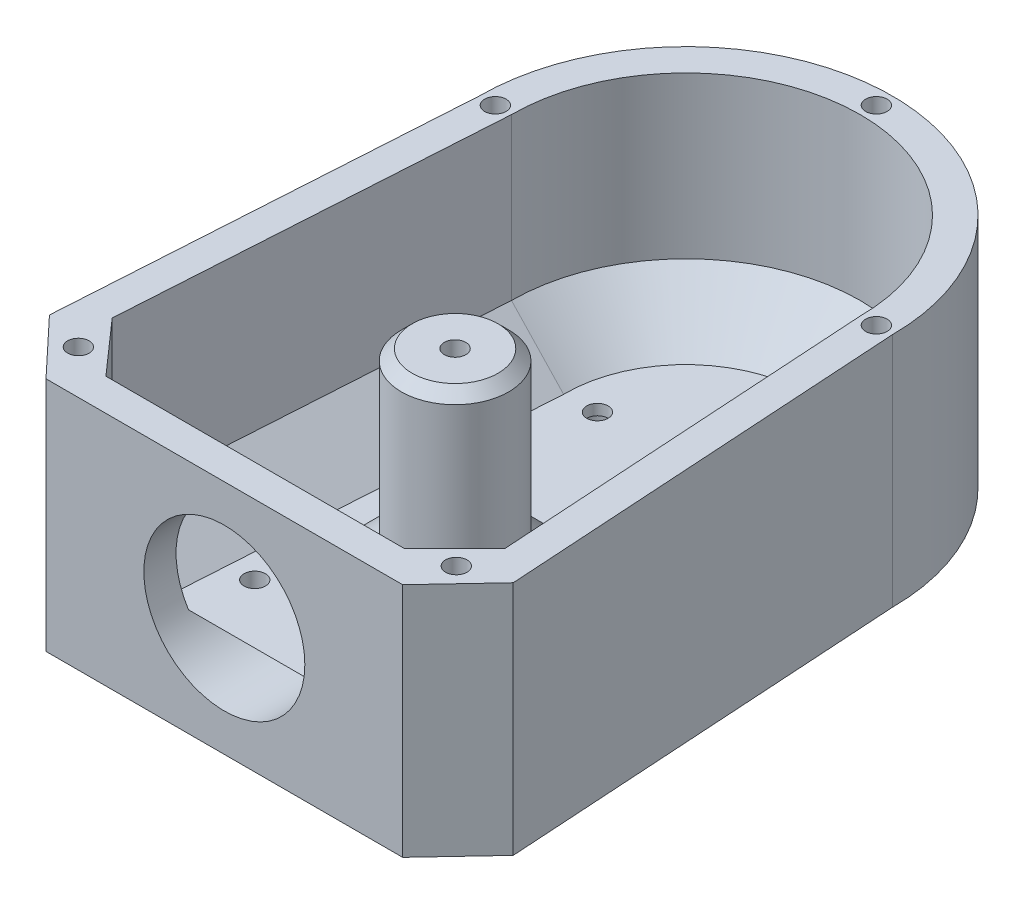
ISO-10303-21;
HEADER;
FILE_DESCRIPTION(('STEP AP214'),'2;1');
FILE_NAME('part.step','',(''),(''),'','','');
FILE_SCHEMA(('AUTOMOTIVE_DESIGN { 1 0 10303 214 1 1 1 1 }'));
ENDSEC;
DATA;
#1=APPLICATION_CONTEXT('core data for automotive mechanical design processes');
#2=APPLICATION_PROTOCOL_DEFINITION('international standard','automotive_design',2000,#1);
#3=PRODUCT_CONTEXT('',#1,'mechanical');
#4=PRODUCT('Part','Part','',(#3));
#5=PRODUCT_RELATED_PRODUCT_CATEGORY('part','',(#4));
#6=PRODUCT_DEFINITION_FORMATION('','',#4);
#7=PRODUCT_DEFINITION_CONTEXT('part definition',#1,'design');
#8=PRODUCT_DEFINITION('design','',#6,#7);
#9=PRODUCT_DEFINITION_SHAPE('','',#8);
#10=(LENGTH_UNIT() NAMED_UNIT(*) SI_UNIT(.MILLI.,.METRE.));
#11=(NAMED_UNIT(*) PLANE_ANGLE_UNIT() SI_UNIT($,.RADIAN.));
#12=(NAMED_UNIT(*) SI_UNIT($,.STERADIAN.) SOLID_ANGLE_UNIT());
#13=UNCERTAINTY_MEASURE_WITH_UNIT(LENGTH_MEASURE(1.E-05),#10,'distance_accuracy_value','');
#14=(GEOMETRIC_REPRESENTATION_CONTEXT(3) GLOBAL_UNCERTAINTY_ASSIGNED_CONTEXT((#13)) GLOBAL_UNIT_ASSIGNED_CONTEXT((#10,
#11,#12)) REPRESENTATION_CONTEXT('',''));
#15=CARTESIAN_POINT('',(0.,0.,0.));
#16=DIRECTION('',(0.,0.,1.));
#17=DIRECTION('',(1.,0.,0.));
#18=AXIS2_PLACEMENT_3D('',#15,#16,#17);
#19=CARTESIAN_POINT('',(0.,4.,0.));
#20=DIRECTION('',(0.,1.,0.));
#21=DIRECTION('',(0.,0.,1.));
#22=AXIS2_PLACEMENT_3D('',#19,#20,#21);
#23=PLANE('',#22);
#24=CARTESIAN_POINT('',(0.,4.,16.5));
#25=DIRECTION('',(0.,1.,0.));
#26=DIRECTION('',(0.,0.,1.));
#27=AXIS2_PLACEMENT_3D('',#24,#25,#26);
#28=CIRCLE('',#27,2.);
#29=CARTESIAN_POINT('',(0.,4.,18.5));
#30=VERTEX_POINT('',#29);
#31=EDGE_CURVE('E288',#30,#30,#28,.T.);
#32=ORIENTED_EDGE('',*,*,#31,.F.);
#33=EDGE_LOOP('',(#32));
#34=FACE_BOUND('',#33,.T.);
#35=CARTESIAN_POINT('',(-21.3337987087621,4.,59.));
#36=DIRECTION('',(0.,1.,0.));
#37=DIRECTION('',(0.,0.,1.));
#38=AXIS2_PLACEMENT_3D('',#35,#36,#37);
#39=CIRCLE('',#38,2.);
#40=CARTESIAN_POINT('',(-21.3337987087621,4.,61.));
#41=VERTEX_POINT('',#40);
#42=EDGE_CURVE('E609',#41,#41,#39,.T.);
#43=ORIENTED_EDGE('',*,*,#42,.F.);
#44=EDGE_LOOP('',(#43));
#45=FACE_BOUND('',#44,.T.);
#46=CARTESIAN_POINT('',(21.3337987087621,4.,59.));
#47=DIRECTION('',(0.,1.,0.));
#48=DIRECTION('',(0.,0.,1.));
#49=AXIS2_PLACEMENT_3D('',#46,#47,#48);
#50=CIRCLE('',#49,2.);
#51=CARTESIAN_POINT('',(21.3337987087621,4.,61.));
#52=VERTEX_POINT('',#51);
#53=EDGE_CURVE('E612',#52,#52,#50,.T.);
#54=ORIENTED_EDGE('',*,*,#53,.F.);
#55=EDGE_LOOP('',(#54));
#56=FACE_BOUND('',#55,.T.);
#57=CARTESIAN_POINT('',(-16.48,4.,0.));
#58=DIRECTION('',(0.,1.,0.));
#59=DIRECTION('',(0.,0.,1.));
#60=AXIS2_PLACEMENT_3D('',#57,#58,#59);
#61=CIRCLE('',#60,2.);
#62=CARTESIAN_POINT('',(-16.48,4.,1.99999999999999));
#63=VERTEX_POINT('',#62);
#64=EDGE_CURVE('E318',#63,#63,#61,.T.);
#65=ORIENTED_EDGE('',*,*,#64,.F.);
#66=EDGE_LOOP('',(#65));
#67=FACE_BOUND('',#66,.T.);
#68=CARTESIAN_POINT('',(16.48,4.,0.));
#69=DIRECTION('',(0.,1.,0.));
#70=DIRECTION('',(0.,0.,1.));
#71=AXIS2_PLACEMENT_3D('',#68,#69,#70);
#72=CIRCLE('',#71,2.);
#73=CARTESIAN_POINT('',(16.48,4.,2.));
#74=VERTEX_POINT('',#73);
#75=EDGE_CURVE('E284',#74,#74,#72,.T.);
#76=ORIENTED_EDGE('',*,*,#75,.F.);
#77=EDGE_LOOP('',(#76));
#78=FACE_BOUND('',#77,.T.);
#79=CARTESIAN_POINT('',(0.,4.,43.));
#80=DIRECTION('',(0.,1.,0.));
#81=DIRECTION('',(0.,0.,1.));
#82=AXIS2_PLACEMENT_3D('',#79,#80,#81);
#83=CIRCLE('',#82,20.);
#84=CARTESIAN_POINT('',(0.,4.,63.));
#85=VERTEX_POINT('',#84);
#86=EDGE_CURVE('E272',#85,#85,#83,.F.);
#87=ORIENTED_EDGE('',*,*,#86,.T.);
#88=EDGE_LOOP('',(#87));
#89=FACE_BOUND('',#88,.T.);
#90=DIRECTION('',(1.,0.,0.));
#91=VECTOR('',#90,1.);
#92=CARTESIAN_POINT('',(0.,4.,70.));
#93=LINE('',#92,#91);
#94=CARTESIAN_POINT('',(-26.8554877863241,4.,70.));
#95=VERTEX_POINT('',#94);
#96=CARTESIAN_POINT('',(26.8554877863241,4.,70.));
#97=VERTEX_POINT('',#96);
#98=EDGE_CURVE('E397',#95,#97,#93,.T.);
#99=ORIENTED_EDGE('',*,*,#98,.T.);
#100=DIRECTION('',(-0.0623782861551806,0.,-0.998052578482889));
#101=VECTOR('',#100,1.);
#102=CARTESIAN_POINT('',(22.3930150712022,4.,-1.39956344195014));
#103=LINE('',#102,#101);
#104=CARTESIAN_POINT('',(22.498212646903,4.,0.283597769262948));
#105=VERTEX_POINT('',#104);
#106=EDGE_CURVE('E183',#97,#105,#103,.T.);
#107=ORIENTED_EDGE('',*,*,#106,.T.);
#108=CARTESIAN_POINT('',(0.,4.,0.));
#109=DIRECTION('',(0.,1.,0.));
#110=DIRECTION('',(0.,0.,1.));
#111=AXIS2_PLACEMENT_3D('',#108,#109,#110);
#112=CIRCLE('',#111,22.5);
#113=CARTESIAN_POINT('',(-22.498212646903,4.,0.283597769262998));
#114=VERTEX_POINT('',#113);
#115=EDGE_CURVE('E391',#105,#114,#112,.T.);
#116=ORIENTED_EDGE('',*,*,#115,.T.);
#117=DIRECTION('',(-0.0623782861551804,0.,0.998052578482889));
#118=VECTOR('',#117,1.);
#119=CARTESIAN_POINT('',(-22.3930150712022,4.,-1.39956344195013));
#120=LINE('',#119,#118);
#121=EDGE_CURVE('E395',#114,#95,#120,.T.);
#122=ORIENTED_EDGE('',*,*,#121,.T.);
#123=EDGE_LOOP('',(#99,#107,#116,#122));
#124=FACE_BOUND('',#123,.T.);
#125=ADVANCED_FACE('F42',(#34,#45,#56,#67,#78,#89,#124),#23,.T.);
#126=CARTESIAN_POINT('',(-38.5,0.,0.));
#127=DIRECTION('',(-0.998052578482888,0.,-0.0623782861551804));
#128=DIRECTION('',(-0.0623782861551804,0.,0.998052578482889));
#129=AXIS2_PLACEMENT_3D('',#126,#127,#128);
#130=PLANE('',#129);
#131=DIRECTION('',(-0.0623782861551804,0.,0.998052578482889));
#132=VECTOR('',#131,1.);
#133=CARTESIAN_POINT('',(-38.5,0.,0.));
#134=LINE('',#133,#132);
#135=CARTESIAN_POINT('',(-38.5,0.,0.));
#136=VERTEX_POINT('',#135);
#137=CARTESIAN_POINT('',(-43.211013571153,0.,75.3762171384481));
#138=VERTEX_POINT('',#137);
#139=EDGE_CURVE('E376',#136,#138,#134,.T.);
#140=ORIENTED_EDGE('',*,*,#139,.T.);
#141=DIRECTION('',(0.,1.,0.));
#142=VECTOR('',#141,1.);
#143=CARTESIAN_POINT('',(-43.211013571153,0.,75.3762171384481));
#144=LINE('',#143,#142);
#145=CARTESIAN_POINT('',(-43.211013571153,44.,75.3762171384481));
#146=VERTEX_POINT('',#145);
#147=EDGE_CURVE('E249',#138,#146,#144,.T.);
#148=ORIENTED_EDGE('',*,*,#147,.T.);
#149=DIRECTION('',(-0.0623782861551804,0.,0.998052578482889));
#150=VECTOR('',#149,1.);
#151=CARTESIAN_POINT('',(-38.5,44.,0.));
#152=LINE('',#151,#150);
#153=CARTESIAN_POINT('',(-38.5,44.,0.));
#154=VERTEX_POINT('',#153);
#155=EDGE_CURVE('E361',#154,#146,#152,.T.);
#156=ORIENTED_EDGE('',*,*,#155,.F.);
#157=DIRECTION('',(0.,1.,0.));
#158=VECTOR('',#157,1.);
#159=CARTESIAN_POINT('',(-38.5,0.,0.));
#160=LINE('',#159,#158);
#161=EDGE_CURVE('E389',#136,#154,#160,.T.);
#162=ORIENTED_EDGE('',*,*,#161,.F.);
#163=EDGE_LOOP('',(#140,#148,#156,#162));
#164=FACE_BOUND('',#163,.T.);
#165=ADVANCED_FACE('F447',(#164),#130,.T.);
#166=CARTESIAN_POINT('',(0.,0.,0.));
#167=DIRECTION('',(0.,1.,0.));
#168=DIRECTION('',(0.,0.,1.));
#169=AXIS2_PLACEMENT_3D('',#166,#167,#168);
#170=CYLINDRICAL_SURFACE('',#169,38.5);
#171=ORIENTED_EDGE('',*,*,#161,.T.);
#172=CARTESIAN_POINT('',(0.,44.,0.));
#173=DIRECTION('',(0.,1.,0.));
#174=DIRECTION('',(0.,0.,1.));
#175=AXIS2_PLACEMENT_3D('',#172,#173,#174);
#176=CIRCLE('',#175,38.5);
#177=CARTESIAN_POINT('',(38.5,44.,0.));
#178=VERTEX_POINT('',#177);
#179=EDGE_CURVE('E369',#178,#154,#176,.T.);
#180=ORIENTED_EDGE('',*,*,#179,.F.);
#181=DIRECTION('',(0.,1.,0.));
#182=VECTOR('',#181,1.);
#183=CARTESIAN_POINT('',(38.5,0.,0.));
#184=LINE('',#183,#182);
#185=CARTESIAN_POINT('',(38.5,0.,0.));
#186=VERTEX_POINT('',#185);
#187=EDGE_CURVE('E388',#186,#178,#184,.T.);
#188=ORIENTED_EDGE('',*,*,#187,.F.);
#189=CARTESIAN_POINT('',(0.,0.,0.));
#190=DIRECTION('',(0.,1.,0.));
#191=DIRECTION('',(0.,0.,1.));
#192=AXIS2_PLACEMENT_3D('',#189,#190,#191);
#193=CIRCLE('',#192,38.5);
#194=EDGE_CURVE('E385',#186,#136,#193,.T.);
#195=ORIENTED_EDGE('',*,*,#194,.T.);
#196=EDGE_LOOP('',(#171,#180,#188,#195));
#197=FACE_BOUND('',#196,.T.);
#198=ADVANCED_FACE('F453',(#197),#170,.T.);
#199=CARTESIAN_POINT('',(43.5,0.,80.));
#200=DIRECTION('',(0.998052578482888,0.,-0.0623782861551807));
#201=DIRECTION('',(-0.0623782861551807,0.,-0.998052578482889));
#202=AXIS2_PLACEMENT_3D('',#199,#200,#201);
#203=PLANE('',#202);
#204=DIRECTION('',(-0.0623782861551807,0.,-0.998052578482889));
#205=VECTOR('',#204,1.);
#206=CARTESIAN_POINT('',(43.5,44.,80.));
#207=LINE('',#206,#205);
#208=CARTESIAN_POINT('',(43.211013571153,44.,75.3762171384481));
#209=VERTEX_POINT('',#208);
#210=EDGE_CURVE('E367',#209,#178,#207,.T.);
#211=ORIENTED_EDGE('',*,*,#210,.F.);
#212=DIRECTION('',(0.,-1.,0.));
#213=VECTOR('',#212,1.);
#214=CARTESIAN_POINT('',(43.211013571153,0.,75.3762171384481));
#215=LINE('',#214,#213);
#216=CARTESIAN_POINT('',(43.211013571153,0.,75.3762171384481));
#217=VERTEX_POINT('',#216);
#218=EDGE_CURVE('E243',#209,#217,#215,.T.);
#219=ORIENTED_EDGE('',*,*,#218,.T.);
#220=DIRECTION('',(-0.0623782861551807,0.,-0.998052578482889));
#221=VECTOR('',#220,1.);
#222=CARTESIAN_POINT('',(43.5,0.,80.));
#223=LINE('',#222,#221);
#224=EDGE_CURVE('E383',#217,#186,#223,.T.);
#225=ORIENTED_EDGE('',*,*,#224,.T.);
#226=ORIENTED_EDGE('',*,*,#187,.T.);
#227=EDGE_LOOP('',(#211,#219,#225,#226));
#228=FACE_BOUND('',#227,.T.);
#229=ADVANCED_FACE('F493',(#228),#203,.T.);
#230=CARTESIAN_POINT('',(-43.5,0.,86.));
#231=DIRECTION('',(0.,0.,1.));
#232=DIRECTION('',(1.,0.,0.));
#233=AXIS2_PLACEMENT_3D('',#230,#231,#232);
#234=PLANE('',#233);
#235=CARTESIAN_POINT('',(0.,22.,86.));
#236=DIRECTION('',(0.,0.,1.));
#237=DIRECTION('',(1.,0.,0.));
#238=AXIS2_PLACEMENT_3D('',#235,#236,#237);
#239=CIRCLE('',#238,15.);
#240=CARTESIAN_POINT('',(15.,22.,86.));
#241=VERTEX_POINT('',#240);
#242=EDGE_CURVE('E173',#241,#241,#239,.T.);
#243=ORIENTED_EDGE('',*,*,#242,.F.);
#244=EDGE_LOOP('',(#243));
#245=FACE_BOUND('',#244,.T.);
#246=DIRECTION('',(1.,0.,0.));
#247=VECTOR('',#246,1.);
#248=CARTESIAN_POINT('',(-43.5,0.,86.));
#249=LINE('',#248,#247);
#250=CARTESIAN_POINT('',(-33.2304877863241,0.,86.));
#251=VERTEX_POINT('',#250);
#252=CARTESIAN_POINT('',(33.230487786324,0.,86.));
#253=VERTEX_POINT('',#252);
#254=EDGE_CURVE('E380',#251,#253,#249,.T.);
#255=ORIENTED_EDGE('',*,*,#254,.T.);
#256=DIRECTION('',(0.,1.,0.));
#257=VECTOR('',#256,1.);
#258=CARTESIAN_POINT('',(33.230487786324,0.,86.));
#259=LINE('',#258,#257);
#260=CARTESIAN_POINT('',(33.230487786324,44.,86.));
#261=VERTEX_POINT('',#260);
#262=EDGE_CURVE('E236',#253,#261,#259,.T.);
#263=ORIENTED_EDGE('',*,*,#262,.T.);
#264=DIRECTION('',(1.,0.,0.));
#265=VECTOR('',#264,1.);
#266=CARTESIAN_POINT('',(-43.5,44.,86.));
#267=LINE('',#266,#265);
#268=CARTESIAN_POINT('',(-33.2304877863241,44.,86.));
#269=VERTEX_POINT('',#268);
#270=EDGE_CURVE('E364',#269,#261,#267,.T.);
#271=ORIENTED_EDGE('',*,*,#270,.F.);
#272=DIRECTION('',(0.,-1.,0.));
#273=VECTOR('',#272,1.);
#274=CARTESIAN_POINT('',(-33.2304877863241,0.,86.));
#275=LINE('',#274,#273);
#276=EDGE_CURVE('E190',#269,#251,#275,.T.);
#277=ORIENTED_EDGE('',*,*,#276,.T.);
#278=EDGE_LOOP('',(#255,#263,#271,#277));
#279=FACE_BOUND('',#278,.T.);
#280=ADVANCED_FACE('F484',(#245,#279),#234,.T.);
#281=CARTESIAN_POINT('',(0.,0.,0.));
#282=DIRECTION('',(0.,1.,0.));
#283=DIRECTION('',(0.,0.,1.));
#284=AXIS2_PLACEMENT_3D('',#281,#282,#283);
#285=CYLINDRICAL_SURFACE('',#284,32.5);
#286=DIRECTION('',(0.,1.,0.));
#287=VECTOR('',#286,1.);
#288=CARTESIAN_POINT('',(-32.5,0.,0.));
#289=LINE('',#288,#287);
#290=CARTESIAN_POINT('',(-32.5,14.,0.));
#291=VERTEX_POINT('',#290);
#292=CARTESIAN_POINT('',(-32.5,44.,0.));
#293=VERTEX_POINT('',#292);
#294=EDGE_CURVE('E372',#291,#293,#289,.T.);
#295=ORIENTED_EDGE('',*,*,#294,.F.);
#296=CARTESIAN_POINT('',(0.,14.,0.));
#297=DIRECTION('',(0.,1.,0.));
#298=DIRECTION('',(0.,0.,1.));
#299=AXIS2_PLACEMENT_3D('',#296,#297,#298);
#300=CIRCLE('',#299,32.5);
#301=CARTESIAN_POINT('',(32.5,14.,0.));
#302=VERTEX_POINT('',#301);
#303=EDGE_CURVE('E188',#291,#302,#300,.F.);
#304=ORIENTED_EDGE('',*,*,#303,.T.);
#305=DIRECTION('',(0.,1.,0.));
#306=VECTOR('',#305,1.);
#307=CARTESIAN_POINT('',(32.5,0.,0.));
#308=LINE('',#307,#306);
#309=CARTESIAN_POINT('',(32.5,44.,0.));
#310=VERTEX_POINT('',#309);
#311=EDGE_CURVE('E373',#302,#310,#308,.T.);
#312=ORIENTED_EDGE('',*,*,#311,.T.);
#313=CARTESIAN_POINT('',(0.,44.,0.));
#314=DIRECTION('',(0.,1.,0.));
#315=DIRECTION('',(0.,0.,1.));
#316=AXIS2_PLACEMENT_3D('',#313,#314,#315);
#317=CIRCLE('',#316,32.5);
#318=EDGE_CURVE('E234',#310,#293,#317,.T.);
#319=ORIENTED_EDGE('',*,*,#318,.T.);
#320=EDGE_LOOP('',(#295,#304,#312,#319));
#321=FACE_BOUND('',#320,.T.);
#322=ADVANCED_FACE('F428',(#321),#285,.F.);
#323=CARTESIAN_POINT('',(37.5,0.,80.));
#324=DIRECTION('',(0.998052578482888,0.,-0.0623782861551806));
#325=DIRECTION('',(-0.0623782861551806,0.,-0.998052578482889));
#326=AXIS2_PLACEMENT_3D('',#323,#324,#325);
#327=PLANE('',#326);
#328=DIRECTION('',(0.0623782861551806,0.,0.998052578482889));
#329=VECTOR('',#328,1.);
#330=CARTESIAN_POINT('',(37.5,14.,80.));
#331=LINE('',#330,#329);
#332=CARTESIAN_POINT('',(36.9117647058824,14.,70.5882352941176));
#333=VERTEX_POINT('',#332);
#334=EDGE_CURVE('E180',#302,#333,#331,.T.);
#335=ORIENTED_EDGE('',*,*,#334,.T.);
#336=DIRECTION('',(0.,1.,0.));
#337=VECTOR('',#336,1.);
#338=CARTESIAN_POINT('',(36.9117647058824,44.,70.5882352941176));
#339=LINE('',#338,#337);
#340=CARTESIAN_POINT('',(36.9117647058824,44.,70.5882352941176));
#341=VERTEX_POINT('',#340);
#342=EDGE_CURVE('E263',#333,#341,#339,.T.);
#343=ORIENTED_EDGE('',*,*,#342,.T.);
#344=DIRECTION('',(-0.0623782861551806,0.,-0.998052578482889));
#345=VECTOR('',#344,1.);
#346=CARTESIAN_POINT('',(37.5,44.,80.));
#347=LINE('',#346,#345);
#348=EDGE_CURVE('E359',#341,#310,#347,.T.);
#349=ORIENTED_EDGE('',*,*,#348,.T.);
#350=ORIENTED_EDGE('',*,*,#311,.F.);
#351=EDGE_LOOP('',(#335,#343,#349,#350));
#352=FACE_BOUND('',#351,.T.);
#353=ADVANCED_FACE('F419',(#352),#327,.F.);
#354=CARTESIAN_POINT('',(-37.5,0.,80.));
#355=DIRECTION('',(0.,0.,1.));
#356=DIRECTION('',(1.,0.,0.));
#357=AXIS2_PLACEMENT_3D('',#354,#355,#356);
#358=PLANE('',#357);
#359=DIRECTION('',(-1.,0.,0.));
#360=VECTOR('',#359,1.);
#361=CARTESIAN_POINT('',(-37.5,14.,80.));
#362=LINE('',#361,#360);
#363=CARTESIAN_POINT('',(27.5,14.,80.));
#364=VERTEX_POINT('',#363);
#365=CARTESIAN_POINT('',(12.6885775404495,14.,80.));
#366=VERTEX_POINT('',#365);
#367=EDGE_CURVE('E171',#364,#366,#362,.T.);
#368=ORIENTED_EDGE('',*,*,#367,.T.);
#369=CARTESIAN_POINT('',(0.,22.,80.));
#370=DIRECTION('',(0.,0.,1.));
#371=DIRECTION('',(1.,0.,0.));
#372=AXIS2_PLACEMENT_3D('',#369,#370,#371);
#373=CIRCLE('',#372,15.);
#374=CARTESIAN_POINT('',(-12.6885775404495,14.,80.));
#375=VERTEX_POINT('',#374);
#376=EDGE_CURVE('E59',#366,#375,#373,.T.);
#377=ORIENTED_EDGE('',*,*,#376,.T.);
#378=CARTESIAN_POINT('',(-28.0698708577168,14.,80.));
#379=VERTEX_POINT('',#378);
#380=EDGE_CURVE('E169',#375,#379,#362,.T.);
#381=ORIENTED_EDGE('',*,*,#380,.T.);
#382=DIRECTION('',(0.,1.,0.));
#383=VECTOR('',#382,1.);
#384=CARTESIAN_POINT('',(-28.0698708577168,44.,80.));
#385=LINE('',#384,#383);
#386=CARTESIAN_POINT('',(-28.0698708577168,44.,80.));
#387=VERTEX_POINT('',#386);
#388=EDGE_CURVE('E254',#379,#387,#385,.T.);
#389=ORIENTED_EDGE('',*,*,#388,.T.);
#390=DIRECTION('',(1.,0.,0.));
#391=VECTOR('',#390,1.);
#392=CARTESIAN_POINT('',(-37.5,44.,80.));
#393=LINE('',#392,#391);
#394=CARTESIAN_POINT('',(27.5,44.,80.));
#395=VERTEX_POINT('',#394);
#396=EDGE_CURVE('E356',#387,#395,#393,.T.);
#397=ORIENTED_EDGE('',*,*,#396,.T.);
#398=DIRECTION('',(0.,-1.,0.));
#399=VECTOR('',#398,1.);
#400=CARTESIAN_POINT('',(27.5,14.,80.));
#401=LINE('',#400,#399);
#402=EDGE_CURVE('E252',#395,#364,#401,.T.);
#403=ORIENTED_EDGE('',*,*,#402,.T.);
#404=EDGE_LOOP('',(#368,#377,#381,#389,#397,#403));
#405=FACE_BOUND('',#404,.T.);
#406=ADVANCED_FACE('F167',(#405),#358,.F.);
#407=CARTESIAN_POINT('',(-32.5,0.,0.));
#408=DIRECTION('',(-0.998052578482888,0.,-0.0623782861551804));
#409=DIRECTION('',(-0.0623782861551804,0.,0.998052578482889));
#410=AXIS2_PLACEMENT_3D('',#407,#408,#409);
#411=PLANE('',#410);
#412=DIRECTION('',(-0.0623782861551804,0.,0.998052578482889));
#413=VECTOR('',#412,1.);
#414=CARTESIAN_POINT('',(-32.5,44.,0.));
#415=LINE('',#414,#413);
#416=CARTESIAN_POINT('',(-36.8762171384482,44.,70.0194742151712));
#417=VERTEX_POINT('',#416);
#418=EDGE_CURVE('E353',#293,#417,#415,.T.);
#419=ORIENTED_EDGE('',*,*,#418,.T.);
#420=DIRECTION('',(0.,-1.,0.));
#421=VECTOR('',#420,1.);
#422=CARTESIAN_POINT('',(-36.8762171384482,14.,70.0194742151712));
#423=LINE('',#422,#421);
#424=CARTESIAN_POINT('',(-36.8762171384482,14.,70.0194742151712));
#425=VERTEX_POINT('',#424);
#426=EDGE_CURVE('E256',#417,#425,#423,.T.);
#427=ORIENTED_EDGE('',*,*,#426,.T.);
#428=DIRECTION('',(0.0623782861551804,0.,-0.998052578482889));
#429=VECTOR('',#428,1.);
#430=CARTESIAN_POINT('',(-32.5,14.,0.));
#431=LINE('',#430,#429);
#432=EDGE_CURVE('E182',#425,#291,#431,.T.);
#433=ORIENTED_EDGE('',*,*,#432,.T.);
#434=ORIENTED_EDGE('',*,*,#294,.T.);
#435=EDGE_LOOP('',(#419,#427,#433,#434));
#436=FACE_BOUND('',#435,.T.);
#437=ADVANCED_FACE('F430',(#436),#411,.F.);
#438=CARTESIAN_POINT('',(0.,44.,0.));
#439=DIRECTION('',(0.,1.,0.));
#440=DIRECTION('',(0.,0.,1.));
#441=AXIS2_PLACEMENT_3D('',#438,#439,#440);
#442=PLANE('',#441);
#443=CARTESIAN_POINT('',(0.,44.,-35.5));
#444=DIRECTION('',(0.,1.,0.));
#445=DIRECTION('',(0.,0.,1.));
#446=AXIS2_PLACEMENT_3D('',#443,#444,#445);
#447=CIRCLE('',#446,2.);
#448=CARTESIAN_POINT('',(0.,44.,-33.5));
#449=VERTEX_POINT('',#448);
#450=EDGE_CURVE('E325',#449,#449,#447,.T.);
#451=ORIENTED_EDGE('',*,*,#450,.F.);
#452=EDGE_LOOP('',(#451));
#453=FACE_BOUND('',#452,.T.);
#454=CARTESIAN_POINT('',(-35.5,44.,0.));
#455=DIRECTION('',(0.,1.,0.));
#456=DIRECTION('',(0.,0.,1.));
#457=AXIS2_PLACEMENT_3D('',#454,#455,#456);
#458=CIRCLE('',#457,2.);
#459=CARTESIAN_POINT('',(-35.5,44.,2.));
#460=VERTEX_POINT('',#459);
#461=EDGE_CURVE('E328',#460,#460,#458,.T.);
#462=ORIENTED_EDGE('',*,*,#461,.F.);
#463=EDGE_LOOP('',(#462));
#464=FACE_BOUND('',#463,.T.);
#465=CARTESIAN_POINT('',(-35.3468973384105,44.,77.8489228384048));
#466=DIRECTION('',(0.,1.,0.));
#467=DIRECTION('',(0.,0.,1.));
#468=AXIS2_PLACEMENT_3D('',#465,#466,#467);
#469=CIRCLE('',#468,2.);
#470=CARTESIAN_POINT('',(-35.3468973384105,44.,79.8489228384048));
#471=VERTEX_POINT('',#470);
#472=EDGE_CURVE('E334',#471,#471,#469,.T.);
#473=ORIENTED_EDGE('',*,*,#472,.F.);
#474=EDGE_LOOP('',(#473));
#475=FACE_BOUND('',#474,.T.);
#476=CARTESIAN_POINT('',(35.2133165158398,44.,77.9911131081414));
#477=DIRECTION('',(0.,1.,0.));
#478=DIRECTION('',(0.,0.,1.));
#479=AXIS2_PLACEMENT_3D('',#476,#477,#478);
#480=CIRCLE('',#479,2.);
#481=CARTESIAN_POINT('',(35.2133165158398,44.,79.9911131081414));
#482=VERTEX_POINT('',#481);
#483=EDGE_CURVE('E340',#482,#482,#480,.T.);
#484=ORIENTED_EDGE('',*,*,#483,.F.);
#485=EDGE_LOOP('',(#484));
#486=FACE_BOUND('',#485,.T.);
#487=CARTESIAN_POINT('',(35.5,44.,0.));
#488=DIRECTION('',(0.,1.,0.));
#489=DIRECTION('',(0.,0.,1.));
#490=AXIS2_PLACEMENT_3D('',#487,#488,#489);
#491=CIRCLE('',#490,2.);
#492=CARTESIAN_POINT('',(35.5,44.,2.));
#493=VERTEX_POINT('',#492);
#494=EDGE_CURVE('E346',#493,#493,#491,.T.);
#495=ORIENTED_EDGE('',*,*,#494,.F.);
#496=EDGE_LOOP('',(#495));
#497=FACE_BOUND('',#496,.T.);
#498=ORIENTED_EDGE('',*,*,#270,.T.);
#499=DIRECTION('',(-0.684697639051293,0.,0.728827238155645));
#500=VECTOR('',#499,1.);
#501=CARTESIAN_POINT('',(60.5679352060318,44.,56.90062070502));
#502=LINE('',#501,#500);
#503=EDGE_CURVE('E241',#261,#209,#502,.F.);
#504=ORIENTED_EDGE('',*,*,#503,.T.);
#505=ORIENTED_EDGE('',*,*,#210,.T.);
#506=ORIENTED_EDGE('',*,*,#179,.T.);
#507=ORIENTED_EDGE('',*,*,#155,.T.);
#508=DIRECTION('',(-0.684697639051286,0.,-0.728827238155652));
#509=VECTOR('',#508,1.);
#510=CARTESIAN_POINT('',(-60.5679352060322,44.,56.9006207050192));
#511=LINE('',#510,#509);
#512=EDGE_CURVE('E239',#146,#269,#511,.F.);
#513=ORIENTED_EDGE('',*,*,#512,.T.);
#514=EDGE_LOOP('',(#498,#504,#505,#506,#507,#513));
#515=FACE_BOUND('',#514,.T.);
#516=ORIENTED_EDGE('',*,*,#418,.F.);
#517=ORIENTED_EDGE('',*,*,#318,.F.);
#518=ORIENTED_EDGE('',*,*,#348,.F.);
#519=DIRECTION('',(0.707106781186544,0.,-0.707106781186551));
#520=VECTOR('',#519,1.);
#521=CARTESIAN_POINT('',(36.9117647058824,44.,70.5882352941176));
#522=LINE('',#521,#520);
#523=EDGE_CURVE('E164',#341,#395,#522,.F.);
#524=ORIENTED_EDGE('',*,*,#523,.T.);
#525=ORIENTED_EDGE('',*,*,#396,.F.);
#526=DIRECTION('',(0.661621637086851,0.,0.749837855365089));
#527=VECTOR('',#526,1.);
#528=CARTESIAN_POINT('',(-28.0698708577168,44.,80.));
#529=LINE('',#528,#527);
#530=EDGE_CURVE('E267',#387,#417,#529,.F.);
#531=ORIENTED_EDGE('',*,*,#530,.T.);
#532=EDGE_LOOP('',(#516,#517,#518,#524,#525,#531));
#533=FACE_BOUND('',#532,.T.);
#534=ADVANCED_FACE('F424',(#453,#464,#475,#486,#497,#515,#533),#442,.T.);
#535=CARTESIAN_POINT('',(0.,0.,0.));
#536=DIRECTION('',(0.,1.,0.));
#537=DIRECTION('',(0.,0.,1.));
#538=AXIS2_PLACEMENT_3D('',#535,#536,#537);
#539=PLANE('',#538);
#540=CARTESIAN_POINT('',(0.,0.,16.5));
#541=DIRECTION('',(0.,1.,0.));
#542=DIRECTION('',(0.,0.,1.));
#543=AXIS2_PLACEMENT_3D('',#540,#541,#542);
#544=CIRCLE('',#543,2.);
#545=CARTESIAN_POINT('',(0.,0.,18.5));
#546=VERTEX_POINT('',#545);
#547=EDGE_CURVE('E47',#546,#546,#544,.T.);
#548=ORIENTED_EDGE('',*,*,#547,.T.);
#549=EDGE_LOOP('',(#548));
#550=FACE_BOUND('',#549,.T.);
#551=CARTESIAN_POINT('',(-21.3337987087621,0.,59.));
#552=DIRECTION('',(0.,1.,0.));
#553=DIRECTION('',(0.,0.,1.));
#554=AXIS2_PLACEMENT_3D('',#551,#552,#553);
#555=CIRCLE('',#554,2.);
#556=CARTESIAN_POINT('',(-21.3337987087621,0.,61.));
#557=VERTEX_POINT('',#556);
#558=EDGE_CURVE('E287',#557,#557,#555,.T.);
#559=ORIENTED_EDGE('',*,*,#558,.T.);
#560=EDGE_LOOP('',(#559));
#561=FACE_BOUND('',#560,.T.);
#562=CARTESIAN_POINT('',(21.3337987087621,0.,59.));
#563=DIRECTION('',(0.,1.,0.));
#564=DIRECTION('',(0.,0.,1.));
#565=AXIS2_PLACEMENT_3D('',#562,#563,#564);
#566=CIRCLE('',#565,2.);
#567=CARTESIAN_POINT('',(21.3337987087621,0.,61.));
#568=VERTEX_POINT('',#567);
#569=EDGE_CURVE('E285',#568,#568,#566,.T.);
#570=ORIENTED_EDGE('',*,*,#569,.T.);
#571=EDGE_LOOP('',(#570));
#572=FACE_BOUND('',#571,.T.);
#573=CARTESIAN_POINT('',(-16.48,0.,0.));
#574=DIRECTION('',(0.,-1.,0.));
#575=DIRECTION('',(0.,0.,-1.));
#576=AXIS2_PLACEMENT_3D('',#573,#574,#575);
#577=CIRCLE('',#576,3.5);
#578=CARTESIAN_POINT('',(-16.48,0.,-3.50000000000001));
#579=VERTEX_POINT('',#578);
#580=EDGE_CURVE('E306',#579,#579,#577,.T.);
#581=ORIENTED_EDGE('',*,*,#580,.F.);
#582=EDGE_LOOP('',(#581));
#583=FACE_BOUND('',#582,.T.);
#584=CARTESIAN_POINT('',(16.48,0.,0.));
#585=DIRECTION('',(0.,-1.,0.));
#586=DIRECTION('',(0.,0.,-1.));
#587=AXIS2_PLACEMENT_3D('',#584,#585,#586);
#588=CIRCLE('',#587,3.5);
#589=CARTESIAN_POINT('',(16.48,0.,-3.5));
#590=VERTEX_POINT('',#589);
#591=EDGE_CURVE('E309',#590,#590,#588,.T.);
#592=ORIENTED_EDGE('',*,*,#591,.F.);
#593=EDGE_LOOP('',(#592));
#594=FACE_BOUND('',#593,.T.);
#595=ORIENTED_EDGE('',*,*,#224,.F.);
#596=DIRECTION('',(0.684697639051293,0.,-0.728827238155645));
#597=VECTOR('',#596,1.);
#598=CARTESIAN_POINT('',(33.230487786324,0.,86.));
#599=LINE('',#598,#597);
#600=EDGE_CURVE('E247',#217,#253,#599,.F.);
#601=ORIENTED_EDGE('',*,*,#600,.T.);
#602=ORIENTED_EDGE('',*,*,#254,.F.);
#603=DIRECTION('',(0.684697639051286,0.,0.728827238155652));
#604=VECTOR('',#603,1.);
#605=CARTESIAN_POINT('',(-43.211013571153,0.,75.376217138448));
#606=LINE('',#605,#604);
#607=EDGE_CURVE('E245',#251,#138,#606,.F.);
#608=ORIENTED_EDGE('',*,*,#607,.T.);
#609=ORIENTED_EDGE('',*,*,#139,.F.);
#610=ORIENTED_EDGE('',*,*,#194,.F.);
#611=EDGE_LOOP('',(#595,#601,#602,#608,#609,#610));
#612=FACE_BOUND('',#611,.T.);
#613=ADVANCED_FACE('F222',(#550,#561,#572,#583,#594,#612),#539,.F.);
#614=CARTESIAN_POINT('',(-22.3930150712022,4.,-1.39956344195013));
#615=DIRECTION('',(-0.705729746225966,-0.707106781186551,-0.0441081091391228));
#616=DIRECTION('',(-0.0623782861551804,0.,0.998052578482889));
#617=AXIS2_PLACEMENT_3D('',#614,#615,#616);
#618=PLANE('',#617);
#619=ORIENTED_EDGE('',*,*,#432,.F.);
#620=DIRECTION('',(-0.540211804549219,0.577350269189624,-0.612240045155775));
#621=VECTOR('',#620,1.);
#622=CARTESIAN_POINT('',(-26.6388395870979,3.05882352941177,81.6218354400347));
#623=LINE('',#622,#621);
#624=CARTESIAN_POINT('',(-32.343902290593,9.15609770940698,75.156097709407));
#625=VERTEX_POINT('',#624);
#626=EDGE_CURVE('E258',#425,#625,#623,.F.);
#627=ORIENTED_EDGE('',*,*,#626,.T.);
#628=DIRECTION('',(0.601369860027895,-0.564957649496856,-0.564957649496861));
#629=VECTOR('',#628,1.);
#630=CARTESIAN_POINT('',(-17.1433158773838,-5.12411176198579,60.8758882380141));
#631=LINE('',#630,#629);
#632=EDGE_CURVE('E232',#95,#625,#631,.F.);
#633=ORIENTED_EDGE('',*,*,#632,.F.);
#634=ORIENTED_EDGE('',*,*,#121,.F.);
#635=CARTESIAN_POINT('',(-32.5,14.,0.));
#636=CARTESIAN_POINT('',(-30.8332717271832,12.333245083595,0.0524616223290177));
#637=CARTESIAN_POINT('',(-29.1664254963513,10.6665344769914,0.102325576263697));
#638=CARTESIAN_POINT('',(-25.832496378757,7.33320114361872,0.196858168324026));
#639=CARTESIAN_POINT('',(-24.1654134918899,5.66657841688904,0.241526804143667));
#640=CARTESIAN_POINT('',(-22.498212646903,4.,0.28359776926296));
#641=B_SPLINE_CURVE_WITH_KNOTS('',3,(#635,#636,#637,#638,#639,#640),.UNSPECIFIED.,.F.,.F.,(4,2,
4),(0.,7.07312400257139,14.1462511446257),.UNSPECIFIED.);
#642=EDGE_CURVE('E225',#291,#114,#641,.T.);
#643=ORIENTED_EDGE('',*,*,#642,.F.);
#644=EDGE_LOOP('',(#619,#627,#633,#634,#643));
#645=FACE_BOUND('',#644,.T.);
#646=ADVANCED_FACE('F215',(#645),#618,.F.);
#647=CARTESIAN_POINT('',(0.,4.,70.));
#648=DIRECTION('',(0.,-0.707106781186551,0.707106781186544));
#649=DIRECTION('',(1.,0.,0.));
#650=AXIS2_PLACEMENT_3D('',#647,#648,#649);
#651=PLANE('',#650);
#652=ORIENTED_EDGE('',*,*,#380,.F.);
#653=CARTESIAN_POINT('',(0.,22.,88.0000000000001));
#654=DIRECTION('',(0.,-0.707106781186551,0.707106781186544));
#655=DIRECTION('',(0.,0.707106781186544,0.707106781186551));
#656=AXIS2_PLACEMENT_3D('',#653,#654,#655);
#657=ELLIPSE('',#656,21.2132034355965,15.);
#658=EDGE_CURVE('E157',#375,#366,#657,.T.);
#659=ORIENTED_EDGE('',*,*,#658,.T.);
#660=ORIENTED_EDGE('',*,*,#367,.F.);
#661=DIRECTION('',(-0.577350269189624,0.577350269189624,0.57735026918963));
#662=VECTOR('',#661,1.);
#663=CARTESIAN_POINT('',(38.4411764705882,3.05882352941176,69.0588235294117));
#664=LINE('',#663,#662);
#665=CARTESIAN_POINT('',(32.343902290593,9.15609770940698,75.156097709407));
#666=VERTEX_POINT('',#665);
#667=EDGE_CURVE('E260',#364,#666,#664,.F.);
#668=ORIENTED_EDGE('',*,*,#667,.T.);
#669=DIRECTION('',(-0.601369860027895,-0.564957649496856,-0.564957649496861));
#670=VECTOR('',#669,1.);
#671=CARTESIAN_POINT('',(0.983758913710109,-20.305227288268,45.6947727117317));
#672=LINE('',#671,#670);
#673=EDGE_CURVE('E199',#97,#666,#672,.F.);
#674=ORIENTED_EDGE('',*,*,#673,.F.);
#675=ORIENTED_EDGE('',*,*,#98,.F.);
#676=ORIENTED_EDGE('',*,*,#632,.T.);
#677=DIRECTION('',(-0.529338504930445,-0.599916972254492,-0.599916972254498));
#678=VECTOR('',#677,1.);
#679=CARTESIAN_POINT('',(-32.515699002175,8.96139476961401,74.961394769614));
#680=LINE('',#679,#678);
#681=EDGE_CURVE('E178',#625,#379,#680,.F.);
#682=ORIENTED_EDGE('',*,*,#681,.T.);
#683=EDGE_LOOP('',(#652,#659,#660,#668,#674,#675,#676,#682));
#684=FACE_BOUND('',#683,.T.);
#685=ADVANCED_FACE('F175',(#684),#651,.F.);
#686=CARTESIAN_POINT('',(0.,4.,0.));
#687=DIRECTION('',(0.,1.,0.));
#688=DIRECTION('',(0.,0.,1.));
#689=AXIS2_PLACEMENT_3D('',#686,#687,#688);
#690=CONICAL_SURFACE('',#689,22.5,0.785398163397453);
#691=ORIENTED_EDGE('',*,*,#642,.T.);
#692=ORIENTED_EDGE('',*,*,#115,.F.);
#693=CARTESIAN_POINT('',(22.498212646903,4.,0.283597769262948));
#694=CARTESIAN_POINT('',(24.1654134918899,5.66657841688904,0.24152680414364));
#695=CARTESIAN_POINT('',(25.832496378757,7.33320114361871,0.19685816832399));
#696=CARTESIAN_POINT('',(29.1664254963513,10.6665344769914,0.102325576263657));
#697=CARTESIAN_POINT('',(30.8332717271832,12.333245083595,0.0524616223289828));
#698=CARTESIAN_POINT('',(32.5,14.,0.));
#699=B_SPLINE_CURVE_WITH_KNOTS('',3,(#693,#694,#695,#696,#697,#698),.UNSPECIFIED.,.F.,.F.,(4,2,
4),(0.,7.07312714205432,14.1462511446257),.UNSPECIFIED.);
#700=EDGE_CURVE('E191',#302,#105,#699,.F.);
#701=ORIENTED_EDGE('',*,*,#700,.F.);
#702=ORIENTED_EDGE('',*,*,#303,.F.);
#703=EDGE_LOOP('',(#691,#692,#701,#702));
#704=FACE_BOUND('',#703,.T.);
#705=ADVANCED_FACE('F203',(#704),#690,.F.);
#706=CARTESIAN_POINT('',(22.3930150712022,4.,-1.39956344195014));
#707=DIRECTION('',(0.705729746225966,-0.707106781186551,-0.0441081091391229));
#708=DIRECTION('',(-0.0623782861551806,0.,-0.998052578482889));
#709=AXIS2_PLACEMENT_3D('',#706,#707,#708);
#710=PLANE('',#709);
#711=ORIENTED_EDGE('',*,*,#673,.T.);
#712=DIRECTION('',(-0.565729452300742,-0.599916972254492,0.565729452300748));
#713=VECTOR('',#712,1.);
#714=CARTESIAN_POINT('',(32.16029490393,8.961394769614,75.33970509607));
#715=LINE('',#714,#713);
#716=EDGE_CURVE('E67',#666,#333,#715,.F.);
#717=ORIENTED_EDGE('',*,*,#716,.T.);
#718=ORIENTED_EDGE('',*,*,#334,.F.);
#719=ORIENTED_EDGE('',*,*,#700,.T.);
#720=ORIENTED_EDGE('',*,*,#106,.F.);
#721=EDGE_LOOP('',(#711,#717,#718,#719,#720));
#722=FACE_BOUND('',#721,.T.);
#723=ADVANCED_FACE('F207',(#722),#710,.F.);
#724=CARTESIAN_POINT('',(33.230487786324,0.,86.));
#725=DIRECTION('',(-0.728827238155645,0.,-0.684697639051293));
#726=DIRECTION('',(0.,1.,0.));
#727=AXIS2_PLACEMENT_3D('',#724,#725,#726);
#728=PLANE('',#727);
#729=ORIENTED_EDGE('',*,*,#600,.F.);
#730=ORIENTED_EDGE('',*,*,#218,.F.);
#731=ORIENTED_EDGE('',*,*,#503,.F.);
#732=ORIENTED_EDGE('',*,*,#262,.F.);
#733=EDGE_LOOP('',(#729,#730,#731,#732));
#734=FACE_BOUND('',#733,.T.);
#735=ADVANCED_FACE('F214',(#734),#728,.F.);
#736=CARTESIAN_POINT('',(-43.211013571153,0.,75.376217138448));
#737=DIRECTION('',(0.728827238155652,0.,-0.684697639051286));
#738=DIRECTION('',(0.,1.,0.));
#739=AXIS2_PLACEMENT_3D('',#736,#737,#738);
#740=PLANE('',#739);
#741=ORIENTED_EDGE('',*,*,#607,.F.);
#742=ORIENTED_EDGE('',*,*,#276,.F.);
#743=ORIENTED_EDGE('',*,*,#512,.F.);
#744=ORIENTED_EDGE('',*,*,#147,.F.);
#745=EDGE_LOOP('',(#741,#742,#743,#744));
#746=FACE_BOUND('',#745,.T.);
#747=ADVANCED_FACE('F435',(#746),#740,.F.);
#748=CARTESIAN_POINT('',(-28.0698708577168,0.,80.));
#749=DIRECTION('',(0.749837855365089,0.,-0.66162163708685));
#750=DIRECTION('',(0.,-1.,0.));
#751=AXIS2_PLACEMENT_3D('',#748,#749,#750);
#752=PLANE('',#751);
#753=ORIENTED_EDGE('',*,*,#626,.F.);
#754=ORIENTED_EDGE('',*,*,#426,.F.);
#755=ORIENTED_EDGE('',*,*,#530,.F.);
#756=ORIENTED_EDGE('',*,*,#388,.F.);
#757=ORIENTED_EDGE('',*,*,#681,.F.);
#758=EDGE_LOOP('',(#753,#754,#755,#756,#757));
#759=FACE_BOUND('',#758,.T.);
#760=ADVANCED_FACE('F433',(#759),#752,.T.);
#761=CARTESIAN_POINT('',(36.9117647058824,0.,70.5882352941176));
#762=DIRECTION('',(-0.707106781186551,0.,-0.707106781186544));
#763=DIRECTION('',(0.,-1.,0.));
#764=AXIS2_PLACEMENT_3D('',#761,#762,#763);
#765=PLANE('',#764);
#766=ORIENTED_EDGE('',*,*,#667,.F.);
#767=ORIENTED_EDGE('',*,*,#402,.F.);
#768=ORIENTED_EDGE('',*,*,#523,.F.);
#769=ORIENTED_EDGE('',*,*,#342,.F.);
#770=ORIENTED_EDGE('',*,*,#716,.F.);
#771=EDGE_LOOP('',(#766,#767,#768,#769,#770));
#772=FACE_BOUND('',#771,.T.);
#773=ADVANCED_FACE('F415',(#772),#765,.T.);
#774=CARTESIAN_POINT('',(35.5,39.,0.));
#775=DIRECTION('',(0.,1.,0.));
#776=DIRECTION('',(0.,0.,1.));
#777=AXIS2_PLACEMENT_3D('',#774,#775,#776);
#778=CYLINDRICAL_SURFACE('',#777,2.);
#779=CARTESIAN_POINT('',(35.5,39.,0.));
#780=DIRECTION('',(0.,1.,0.));
#781=DIRECTION('',(0.,0.,1.));
#782=AXIS2_PLACEMENT_3D('',#779,#780,#781);
#783=CIRCLE('',#782,2.);
#784=CARTESIAN_POINT('',(35.5,39.,2.));
#785=VERTEX_POINT('',#784);
#786=EDGE_CURVE('E172',#785,#785,#783,.T.);
#787=ORIENTED_EDGE('',*,*,#786,.F.);
#788=EDGE_LOOP('',(#787));
#789=FACE_BOUND('',#788,.T.);
#790=ORIENTED_EDGE('',*,*,#494,.T.);
#791=EDGE_LOOP('',(#790));
#792=FACE_BOUND('',#791,.T.);
#793=ADVANCED_FACE('F441',(#789,#792),#778,.F.);
#794=CARTESIAN_POINT('',(35.5,39.,0.));
#795=DIRECTION('',(0.,1.,0.));
#796=DIRECTION('',(0.,0.,1.));
#797=AXIS2_PLACEMENT_3D('',#794,#795,#796);
#798=PLANE('',#797);
#799=ORIENTED_EDGE('',*,*,#786,.T.);
#800=EDGE_LOOP('',(#799));
#801=FACE_BOUND('',#800,.T.);
#802=ADVANCED_FACE('F511',(#801),#798,.T.);
#803=CARTESIAN_POINT('',(35.2133165158398,39.,77.9911131081414));
#804=DIRECTION('',(0.,1.,0.));
#805=DIRECTION('',(0.,0.,1.));
#806=AXIS2_PLACEMENT_3D('',#803,#804,#805);
#807=CYLINDRICAL_SURFACE('',#806,2.);
#808=CARTESIAN_POINT('',(35.2133165158398,39.,77.9911131081414));
#809=DIRECTION('',(0.,1.,0.));
#810=DIRECTION('',(0.,0.,1.));
#811=AXIS2_PLACEMENT_3D('',#808,#809,#810);
#812=CIRCLE('',#811,2.);
#813=CARTESIAN_POINT('',(35.2133165158398,39.,79.9911131081414));
#814=VERTEX_POINT('',#813);
#815=EDGE_CURVE('E343',#814,#814,#812,.T.);
#816=ORIENTED_EDGE('',*,*,#815,.F.);
#817=EDGE_LOOP('',(#816));
#818=FACE_BOUND('',#817,.T.);
#819=ORIENTED_EDGE('',*,*,#483,.T.);
#820=EDGE_LOOP('',(#819));
#821=FACE_BOUND('',#820,.T.);
#822=ADVANCED_FACE('F514',(#818,#821),#807,.F.);
#823=CARTESIAN_POINT('',(35.2133165158398,39.,77.9911131081414));
#824=DIRECTION('',(0.,1.,0.));
#825=DIRECTION('',(0.,0.,1.));
#826=AXIS2_PLACEMENT_3D('',#823,#824,#825);
#827=PLANE('',#826);
#828=ORIENTED_EDGE('',*,*,#815,.T.);
#829=EDGE_LOOP('',(#828));
#830=FACE_BOUND('',#829,.T.);
#831=ADVANCED_FACE('F519',(#830),#827,.T.);
#832=CARTESIAN_POINT('',(-35.3468973384105,39.,77.8489228384048));
#833=DIRECTION('',(0.,1.,0.));
#834=DIRECTION('',(0.,0.,1.));
#835=AXIS2_PLACEMENT_3D('',#832,#833,#834);
#836=CYLINDRICAL_SURFACE('',#835,2.);
#837=CARTESIAN_POINT('',(-35.3468973384105,39.,77.8489228384048));
#838=DIRECTION('',(0.,1.,0.));
#839=DIRECTION('',(0.,0.,1.));
#840=AXIS2_PLACEMENT_3D('',#837,#838,#839);
#841=CIRCLE('',#840,2.);
#842=CARTESIAN_POINT('',(-35.3468973384105,39.,79.8489228384048));
#843=VERTEX_POINT('',#842);
#844=EDGE_CURVE('E337',#843,#843,#841,.T.);
#845=ORIENTED_EDGE('',*,*,#844,.F.);
#846=EDGE_LOOP('',(#845));
#847=FACE_BOUND('',#846,.T.);
#848=ORIENTED_EDGE('',*,*,#472,.T.);
#849=EDGE_LOOP('',(#848));
#850=FACE_BOUND('',#849,.T.);
#851=ADVANCED_FACE('F522',(#847,#850),#836,.F.);
#852=CARTESIAN_POINT('',(-35.3468973384105,39.,77.8489228384048));
#853=DIRECTION('',(0.,1.,0.));
#854=DIRECTION('',(0.,0.,1.));
#855=AXIS2_PLACEMENT_3D('',#852,#853,#854);
#856=PLANE('',#855);
#857=ORIENTED_EDGE('',*,*,#844,.T.);
#858=EDGE_LOOP('',(#857));
#859=FACE_BOUND('',#858,.T.);
#860=ADVANCED_FACE('F527',(#859),#856,.T.);
#861=CARTESIAN_POINT('',(-35.5,39.,0.));
#862=DIRECTION('',(0.,1.,0.));
#863=DIRECTION('',(0.,0.,1.));
#864=AXIS2_PLACEMENT_3D('',#861,#862,#863);
#865=CYLINDRICAL_SURFACE('',#864,2.);
#866=CARTESIAN_POINT('',(-35.5,39.,0.));
#867=DIRECTION('',(0.,1.,0.));
#868=DIRECTION('',(0.,0.,1.));
#869=AXIS2_PLACEMENT_3D('',#866,#867,#868);
#870=CIRCLE('',#869,2.);
#871=CARTESIAN_POINT('',(-35.5,39.,2.));
#872=VERTEX_POINT('',#871);
#873=EDGE_CURVE('E331',#872,#872,#870,.T.);
#874=ORIENTED_EDGE('',*,*,#873,.F.);
#875=EDGE_LOOP('',(#874));
#876=FACE_BOUND('',#875,.T.);
#877=ORIENTED_EDGE('',*,*,#461,.T.);
#878=EDGE_LOOP('',(#877));
#879=FACE_BOUND('',#878,.T.);
#880=ADVANCED_FACE('F530',(#876,#879),#865,.F.);
#881=CARTESIAN_POINT('',(-35.5,39.,0.));
#882=DIRECTION('',(0.,1.,0.));
#883=DIRECTION('',(0.,0.,1.));
#884=AXIS2_PLACEMENT_3D('',#881,#882,#883);
#885=PLANE('',#884);
#886=ORIENTED_EDGE('',*,*,#873,.T.);
#887=EDGE_LOOP('',(#886));
#888=FACE_BOUND('',#887,.T.);
#889=ADVANCED_FACE('F535',(#888),#885,.T.);
#890=CARTESIAN_POINT('',(0.,39.,-35.5));
#891=DIRECTION('',(0.,1.,0.));
#892=DIRECTION('',(0.,0.,1.));
#893=AXIS2_PLACEMENT_3D('',#890,#891,#892);
#894=CYLINDRICAL_SURFACE('',#893,2.);
#895=CARTESIAN_POINT('',(0.,39.,-35.5));
#896=DIRECTION('',(0.,1.,0.));
#897=DIRECTION('',(0.,0.,1.));
#898=AXIS2_PLACEMENT_3D('',#895,#896,#897);
#899=CIRCLE('',#898,2.);
#900=CARTESIAN_POINT('',(0.,39.,-33.5));
#901=VERTEX_POINT('',#900);
#902=EDGE_CURVE('E200',#901,#901,#899,.T.);
#903=ORIENTED_EDGE('',*,*,#902,.F.);
#904=EDGE_LOOP('',(#903));
#905=FACE_BOUND('',#904,.T.);
#906=ORIENTED_EDGE('',*,*,#450,.T.);
#907=EDGE_LOOP('',(#906));
#908=FACE_BOUND('',#907,.T.);
#909=ADVANCED_FACE('F538',(#905,#908),#894,.F.);
#910=CARTESIAN_POINT('',(0.,39.,-35.5));
#911=DIRECTION('',(0.,1.,0.));
#912=DIRECTION('',(0.,0.,1.));
#913=AXIS2_PLACEMENT_3D('',#910,#911,#912);
#914=PLANE('',#913);
#915=ORIENTED_EDGE('',*,*,#902,.T.);
#916=EDGE_LOOP('',(#915));
#917=FACE_BOUND('',#916,.T.);
#918=ADVANCED_FACE('F545',(#917),#914,.T.);
#919=CARTESIAN_POINT('',(0.,22.,64.));
#920=DIRECTION('',(0.,0.,1.));
#921=DIRECTION('',(1.,0.,0.));
#922=AXIS2_PLACEMENT_3D('',#919,#920,#921);
#923=CYLINDRICAL_SURFACE('',#922,15.);
#924=ORIENTED_EDGE('',*,*,#242,.T.);
#925=EDGE_LOOP('',(#924));
#926=FACE_BOUND('',#925,.T.);
#927=ORIENTED_EDGE('',*,*,#658,.F.);
#928=ORIENTED_EDGE('',*,*,#376,.F.);
#929=EDGE_LOOP('',(#927,#928));
#930=FACE_BOUND('',#929,.T.);
#931=ADVANCED_FACE('F158',(#926,#930),#923,.F.);
#932=CARTESIAN_POINT('',(0.,72.2842712474619,43.));
#933=DIRECTION('',(0.,-1.,0.));
#934=DIRECTION('',(0.,0.,-1.));
#935=AXIS2_PLACEMENT_3D('',#932,#933,#934);
#936=CYLINDRICAL_SURFACE('',#935,10.);
#937=CARTESIAN_POINT('',(0.,42.,43.));
#938=DIRECTION('',(0.,1.,0.));
#939=DIRECTION('',(0.,0.,1.));
#940=AXIS2_PLACEMENT_3D('',#937,#938,#939);
#941=CIRCLE('',#940,10.);
#942=CARTESIAN_POINT('',(0.,42.,53.));
#943=VERTEX_POINT('',#942);
#944=EDGE_CURVE('E12',#943,#943,#941,.F.);
#945=ORIENTED_EDGE('',*,*,#944,.T.);
#946=EDGE_LOOP('',(#945));
#947=FACE_BOUND('',#946,.T.);
#948=CARTESIAN_POINT('',(0.,14.0000000000001,43.));
#949=DIRECTION('',(0.,1.,0.));
#950=DIRECTION('',(0.,0.,1.));
#951=AXIS2_PLACEMENT_3D('',#948,#949,#950);
#952=CIRCLE('',#951,10.);
#953=CARTESIAN_POINT('',(0.,14.0000000000001,53.));
#954=VERTEX_POINT('',#953);
#955=EDGE_CURVE('E163',#954,#954,#952,.T.);
#956=ORIENTED_EDGE('',*,*,#955,.T.);
#957=EDGE_LOOP('',(#956));
#958=FACE_BOUND('',#957,.T.);
#959=ADVANCED_FACE('F552',(#947,#958),#936,.T.);
#960=CARTESIAN_POINT('',(0.,44.,0.));
#961=DIRECTION('',(0.,1.,0.));
#962=DIRECTION('',(0.,0.,1.));
#963=AXIS2_PLACEMENT_3D('',#960,#961,#962);
#964=PLANE('',#963);
#965=CARTESIAN_POINT('',(0.,44.,43.));
#966=DIRECTION('',(0.,1.,0.));
#967=DIRECTION('',(0.,0.,1.));
#968=AXIS2_PLACEMENT_3D('',#965,#966,#967);
#969=CIRCLE('',#968,2.);
#970=CARTESIAN_POINT('',(0.,44.,45.));
#971=VERTEX_POINT('',#970);
#972=EDGE_CURVE('E293',#971,#971,#969,.T.);
#973=ORIENTED_EDGE('',*,*,#972,.F.);
#974=EDGE_LOOP('',(#973));
#975=FACE_BOUND('',#974,.T.);
#976=CARTESIAN_POINT('',(0.,44.,43.));
#977=DIRECTION('',(0.,1.,0.));
#978=DIRECTION('',(0.,0.,1.));
#979=AXIS2_PLACEMENT_3D('',#976,#977,#978);
#980=CIRCLE('',#979,7.99999999999999);
#981=CARTESIAN_POINT('',(0.,44.,51.));
#982=VERTEX_POINT('',#981);
#983=EDGE_CURVE('E52',#982,#982,#980,.T.);
#984=ORIENTED_EDGE('',*,*,#983,.T.);
#985=EDGE_LOOP('',(#984));
#986=FACE_BOUND('',#985,.T.);
#987=ADVANCED_FACE('F554',(#975,#986),#964,.T.);
#988=CARTESIAN_POINT('',(0.,14.0000000000001,43.));
#989=DIRECTION('',(0.,-1.,0.));
#990=DIRECTION('',(0.,0.,-1.));
#991=AXIS2_PLACEMENT_3D('',#988,#989,#990);
#992=CONICAL_SURFACE('',#991,10.,0.785398163397444);
#993=ORIENTED_EDGE('',*,*,#86,.F.);
#994=EDGE_LOOP('',(#993));
#995=FACE_BOUND('',#994,.T.);
#996=ORIENTED_EDGE('',*,*,#955,.F.);
#997=EDGE_LOOP('',(#996));
#998=FACE_BOUND('',#997,.T.);
#999=ADVANCED_FACE('F557',(#995,#998),#992,.T.);
#1000=CARTESIAN_POINT('',(0.,44.,43.));
#1001=DIRECTION('',(0.,-1.,0.));
#1002=DIRECTION('',(0.,0.,-1.));
#1003=AXIS2_PLACEMENT_3D('',#1000,#1001,#1002);
#1004=CONICAL_SURFACE('',#1003,7.99999999999999,0.78539816339745);
#1005=ORIENTED_EDGE('',*,*,#944,.F.);
#1006=EDGE_LOOP('',(#1005));
#1007=FACE_BOUND('',#1006,.T.);
#1008=ORIENTED_EDGE('',*,*,#983,.F.);
#1009=EDGE_LOOP('',(#1008));
#1010=FACE_BOUND('',#1009,.T.);
#1011=ADVANCED_FACE('F45',(#1007,#1010),#1004,.T.);
#1012=CARTESIAN_POINT('',(16.48,10.,0.));
#1013=DIRECTION('',(0.,-1.,0.));
#1014=DIRECTION('',(0.,0.,-1.));
#1015=AXIS2_PLACEMENT_3D('',#1012,#1013,#1014);
#1016=CYLINDRICAL_SURFACE('',#1015,2.);
#1017=CARTESIAN_POINT('',(16.48,2.,0.));
#1018=DIRECTION('',(0.,1.,0.));
#1019=DIRECTION('',(0.,0.,1.));
#1020=AXIS2_PLACEMENT_3D('',#1017,#1018,#1019);
#1021=CIRCLE('',#1020,2.);
#1022=CARTESIAN_POINT('',(16.48,2.,2.));
#1023=VERTEX_POINT('',#1022);
#1024=EDGE_CURVE('E280',#1023,#1023,#1021,.F.);
#1025=ORIENTED_EDGE('',*,*,#1024,.T.);
#1026=EDGE_LOOP('',(#1025));
#1027=FACE_BOUND('',#1026,.T.);
#1028=ORIENTED_EDGE('',*,*,#75,.T.);
#1029=EDGE_LOOP('',(#1028));
#1030=FACE_BOUND('',#1029,.T.);
#1031=ADVANCED_FACE('F562',(#1027,#1030),#1016,.F.);
#1032=CARTESIAN_POINT('',(-16.48,10.,0.));
#1033=DIRECTION('',(0.,-1.,0.));
#1034=DIRECTION('',(0.,0.,-1.));
#1035=AXIS2_PLACEMENT_3D('',#1032,#1033,#1034);
#1036=CYLINDRICAL_SURFACE('',#1035,2.);
#1037=CARTESIAN_POINT('',(-16.48,2.,0.));
#1038=DIRECTION('',(0.,1.,0.));
#1039=DIRECTION('',(0.,0.,1.));
#1040=AXIS2_PLACEMENT_3D('',#1037,#1038,#1039);
#1041=CIRCLE('',#1040,2.);
#1042=CARTESIAN_POINT('',(-16.48,2.,1.99999999999999));
#1043=VERTEX_POINT('',#1042);
#1044=EDGE_CURVE('E277',#1043,#1043,#1041,.F.);
#1045=ORIENTED_EDGE('',*,*,#1044,.T.);
#1046=EDGE_LOOP('',(#1045));
#1047=FACE_BOUND('',#1046,.T.);
#1048=ORIENTED_EDGE('',*,*,#64,.T.);
#1049=EDGE_LOOP('',(#1048));
#1050=FACE_BOUND('',#1049,.T.);
#1051=ADVANCED_FACE('F565',(#1047,#1050),#1036,.F.);
#1052=CARTESIAN_POINT('',(0.,2.,0.));
#1053=DIRECTION('',(0.,1.,0.));
#1054=DIRECTION('',(0.,0.,1.));
#1055=AXIS2_PLACEMENT_3D('',#1052,#1053,#1054);
#1056=PLANE('',#1055);
#1057=CARTESIAN_POINT('',(-16.48,2.,0.));
#1058=DIRECTION('',(0.,1.,0.));
#1059=DIRECTION('',(0.,0.,1.));
#1060=AXIS2_PLACEMENT_3D('',#1057,#1058,#1059);
#1061=CIRCLE('',#1060,3.5);
#1062=CARTESIAN_POINT('',(-16.48,2.,3.49999999999999));
#1063=VERTEX_POINT('',#1062);
#1064=EDGE_CURVE('E281',#1063,#1063,#1061,.F.);
#1065=ORIENTED_EDGE('',*,*,#1064,.T.);
#1066=EDGE_LOOP('',(#1065));
#1067=FACE_BOUND('',#1066,.T.);
#1068=ORIENTED_EDGE('',*,*,#1044,.F.);
#1069=EDGE_LOOP('',(#1068));
#1070=FACE_BOUND('',#1069,.T.);
#1071=ADVANCED_FACE('F569',(#1067,#1070),#1056,.F.);
#1072=CARTESIAN_POINT('',(-16.48,13.8994949366117,0.));
#1073=DIRECTION('',(0.,-1.,0.));
#1074=DIRECTION('',(0.,0.,-1.));
#1075=AXIS2_PLACEMENT_3D('',#1072,#1073,#1074);
#1076=CYLINDRICAL_SURFACE('',#1075,3.5);
#1077=ORIENTED_EDGE('',*,*,#580,.T.);
#1078=EDGE_LOOP('',(#1077));
#1079=FACE_BOUND('',#1078,.T.);
#1080=ORIENTED_EDGE('',*,*,#1064,.F.);
#1081=EDGE_LOOP('',(#1080));
#1082=FACE_BOUND('',#1081,.T.);
#1083=ADVANCED_FACE('F579',(#1079,#1082),#1076,.F.);
#1084=CARTESIAN_POINT('',(0.,2.,0.));
#1085=DIRECTION('',(0.,1.,0.));
#1086=DIRECTION('',(0.,0.,1.));
#1087=AXIS2_PLACEMENT_3D('',#1084,#1085,#1086);
#1088=PLANE('',#1087);
#1089=CARTESIAN_POINT('',(16.48,2.,0.));
#1090=DIRECTION('',(0.,1.,0.));
#1091=DIRECTION('',(0.,0.,1.));
#1092=AXIS2_PLACEMENT_3D('',#1089,#1090,#1091);
#1093=CIRCLE('',#1092,3.5);
#1094=CARTESIAN_POINT('',(16.48,2.,3.5));
#1095=VERTEX_POINT('',#1094);
#1096=EDGE_CURVE('E302',#1095,#1095,#1093,.F.);
#1097=ORIENTED_EDGE('',*,*,#1096,.T.);
#1098=EDGE_LOOP('',(#1097));
#1099=FACE_BOUND('',#1098,.T.);
#1100=ORIENTED_EDGE('',*,*,#1024,.F.);
#1101=EDGE_LOOP('',(#1100));
#1102=FACE_BOUND('',#1101,.T.);
#1103=ADVANCED_FACE('F575',(#1099,#1102),#1088,.F.);
#1104=CARTESIAN_POINT('',(16.48,13.8994949366117,0.));
#1105=DIRECTION('',(0.,-1.,0.));
#1106=DIRECTION('',(0.,0.,-1.));
#1107=AXIS2_PLACEMENT_3D('',#1104,#1105,#1106);
#1108=CYLINDRICAL_SURFACE('',#1107,3.5);
#1109=ORIENTED_EDGE('',*,*,#591,.T.);
#1110=EDGE_LOOP('',(#1109));
#1111=FACE_BOUND('',#1110,.T.);
#1112=ORIENTED_EDGE('',*,*,#1096,.F.);
#1113=EDGE_LOOP('',(#1112));
#1114=FACE_BOUND('',#1113,.T.);
#1115=ADVANCED_FACE('F571',(#1111,#1114),#1108,.F.);
#1116=CARTESIAN_POINT('',(0.,39.,43.));
#1117=DIRECTION('',(0.,1.,0.));
#1118=DIRECTION('',(0.,0.,1.));
#1119=AXIS2_PLACEMENT_3D('',#1116,#1117,#1118);
#1120=CYLINDRICAL_SURFACE('',#1119,2.);
#1121=CARTESIAN_POINT('',(0.,39.,43.));
#1122=DIRECTION('',(0.,1.,0.));
#1123=DIRECTION('',(0.,0.,1.));
#1124=AXIS2_PLACEMENT_3D('',#1121,#1122,#1123);
#1125=CIRCLE('',#1124,2.);
#1126=CARTESIAN_POINT('',(0.,39.,45.));
#1127=VERTEX_POINT('',#1126);
#1128=EDGE_CURVE('E297',#1127,#1127,#1125,.T.);
#1129=ORIENTED_EDGE('',*,*,#1128,.F.);
#1130=EDGE_LOOP('',(#1129));
#1131=FACE_BOUND('',#1130,.T.);
#1132=ORIENTED_EDGE('',*,*,#972,.T.);
#1133=EDGE_LOOP('',(#1132));
#1134=FACE_BOUND('',#1133,.T.);
#1135=ADVANCED_FACE('F574',(#1131,#1134),#1120,.F.);
#1136=CARTESIAN_POINT('',(0.,39.,43.));
#1137=DIRECTION('',(0.,1.,0.));
#1138=DIRECTION('',(0.,0.,1.));
#1139=AXIS2_PLACEMENT_3D('',#1136,#1137,#1138);
#1140=PLANE('',#1139);
#1141=ORIENTED_EDGE('',*,*,#1128,.T.);
#1142=EDGE_LOOP('',(#1141));
#1143=FACE_BOUND('',#1142,.T.);
#1144=ADVANCED_FACE('F589',(#1143),#1140,.T.);
#1145=CARTESIAN_POINT('',(21.3337987087621,-6.,59.));
#1146=DIRECTION('',(0.,1.,0.));
#1147=DIRECTION('',(0.,0.,1.));
#1148=AXIS2_PLACEMENT_3D('',#1145,#1146,#1147);
#1149=CYLINDRICAL_SURFACE('',#1148,2.);
#1150=ORIENTED_EDGE('',*,*,#53,.T.);
#1151=EDGE_LOOP('',(#1150));
#1152=FACE_BOUND('',#1151,.T.);
#1153=ORIENTED_EDGE('',*,*,#569,.F.);
#1154=EDGE_LOOP('',(#1153));
#1155=FACE_BOUND('',#1154,.T.);
#1156=ADVANCED_FACE('F593',(#1152,#1155),#1149,.F.);
#1157=CARTESIAN_POINT('',(-21.3337987087621,-6.,59.));
#1158=DIRECTION('',(0.,1.,0.));
#1159=DIRECTION('',(0.,0.,1.));
#1160=AXIS2_PLACEMENT_3D('',#1157,#1158,#1159);
#1161=CYLINDRICAL_SURFACE('',#1160,2.);
#1162=ORIENTED_EDGE('',*,*,#42,.T.);
#1163=EDGE_LOOP('',(#1162));
#1164=FACE_BOUND('',#1163,.T.);
#1165=ORIENTED_EDGE('',*,*,#558,.F.);
#1166=EDGE_LOOP('',(#1165));
#1167=FACE_BOUND('',#1166,.T.);
#1168=ADVANCED_FACE('F597',(#1164,#1167),#1161,.F.);
#1169=CARTESIAN_POINT('',(0.,-6.,16.5));
#1170=DIRECTION('',(0.,1.,0.));
#1171=DIRECTION('',(0.,0.,1.));
#1172=AXIS2_PLACEMENT_3D('',#1169,#1170,#1171);
#1173=CYLINDRICAL_SURFACE('',#1172,2.);
#1174=ORIENTED_EDGE('',*,*,#31,.T.);
#1175=EDGE_LOOP('',(#1174));
#1176=FACE_BOUND('',#1175,.T.);
#1177=ORIENTED_EDGE('',*,*,#547,.F.);
#1178=EDGE_LOOP('',(#1177));
#1179=FACE_BOUND('',#1178,.T.);
#1180=ADVANCED_FACE('F601',(#1176,#1179),#1173,.F.);
#1181=CLOSED_SHELL('',(#125,#165,#198,#229,#280,#322,#353,#406,#437,#534,#613,#646,#685,#705,
#723,#735,#747,#760,#773,#793,#802,#822,#831,#851,#860,#880,#889,#909,#918,#931,#959,#987,#999,
#1011,#1031,#1051,#1071,#1083,#1103,#1115,#1135,#1144,#1156,#1168,#1180));
#1182=MANIFOLD_SOLID_BREP('B2',#1181);
#1183=ADVANCED_BREP_SHAPE_REPRESENTATION('',(#18,#1182),#14);
#1184=SHAPE_DEFINITION_REPRESENTATION(#9,#1183);
ENDSEC;
END-ISO-10303-21;
